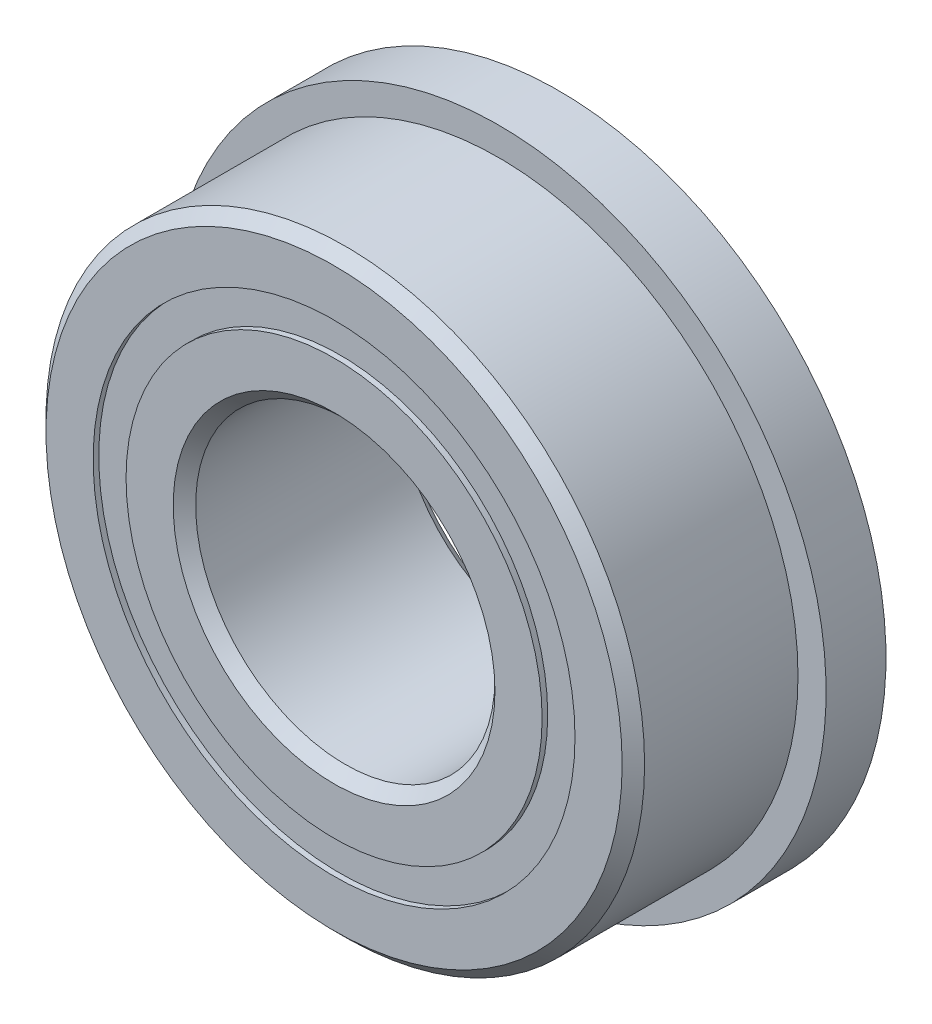
ISO-10303-21;
HEADER;
FILE_DESCRIPTION(('STEP AP214'),'2;1');
FILE_NAME('part.step','',(''),(''),'','','');
FILE_SCHEMA(('AUTOMOTIVE_DESIGN { 1 0 10303 214 1 1 1 1 }'));
ENDSEC;
DATA;
#1=APPLICATION_CONTEXT('core data for automotive mechanical design processes');
#2=APPLICATION_PROTOCOL_DEFINITION('international standard','automotive_design',2000,#1);
#3=PRODUCT_CONTEXT('',#1,'mechanical');
#4=PRODUCT('Part','Part','',(#3));
#5=PRODUCT_RELATED_PRODUCT_CATEGORY('part','',(#4));
#6=PRODUCT_DEFINITION_FORMATION('','',#4);
#7=PRODUCT_DEFINITION_CONTEXT('part definition',#1,'design');
#8=PRODUCT_DEFINITION('design','',#6,#7);
#9=PRODUCT_DEFINITION_SHAPE('','',#8);
#10=(LENGTH_UNIT() NAMED_UNIT(*) SI_UNIT(.MILLI.,.METRE.));
#11=(NAMED_UNIT(*) PLANE_ANGLE_UNIT() SI_UNIT($,.RADIAN.));
#12=(NAMED_UNIT(*) SI_UNIT($,.STERADIAN.) SOLID_ANGLE_UNIT());
#13=UNCERTAINTY_MEASURE_WITH_UNIT(LENGTH_MEASURE(1.E-05),#10,'distance_accuracy_value','');
#14=(GEOMETRIC_REPRESENTATION_CONTEXT(3) GLOBAL_UNCERTAINTY_ASSIGNED_CONTEXT((#13)) GLOBAL_UNIT_ASSIGNED_CONTEXT((#10,
#11,#12)) REPRESENTATION_CONTEXT('',''));
#15=CARTESIAN_POINT('',(0.,0.,0.));
#16=DIRECTION('',(0.,0.,1.));
#17=DIRECTION('',(1.,0.,0.));
#18=AXIS2_PLACEMENT_3D('',#15,#16,#17);
#19=CARTESIAN_POINT('',(0.,5.1114010989011,-2.2621875));
#20=DIRECTION('',(0.,0.,1.));
#21=DIRECTION('',(1.,0.,0.));
#22=AXIS2_PLACEMENT_3D('',#19,#20,#21);
#23=PLANE('',#22);
#24=CARTESIAN_POINT('',(0.,0.,-2.2621875));
#25=DIRECTION('',(0.,0.,1.));
#26=DIRECTION('',(1.,0.,0.));
#27=AXIS2_PLACEMENT_3D('',#24,#25,#26);
#28=CIRCLE('',#27,5.1114010989011);
#29=CARTESIAN_POINT('',(5.1114010989011,0.,-2.2621875));
#30=VERTEX_POINT('',#29);
#31=EDGE_CURVE('E59',#30,#30,#28,.T.);
#32=ORIENTED_EDGE('',*,*,#31,.F.);
#33=EDGE_LOOP('',(#32));
#34=FACE_BOUND('',#33,.T.);
#35=CARTESIAN_POINT('',(0.,0.,-2.2621875));
#36=DIRECTION('',(0.,0.,1.));
#37=DIRECTION('',(1.,0.,0.));
#38=AXIS2_PLACEMENT_3D('',#35,#36,#37);
#39=CIRCLE('',#38,4.4135989010989);
#40=CARTESIAN_POINT('',(4.4135989010989,0.,-2.2621875));
#41=VERTEX_POINT('',#40);
#42=EDGE_CURVE('E11',#41,#41,#39,.T.);
#43=ORIENTED_EDGE('',*,*,#42,.T.);
#44=EDGE_LOOP('',(#43));
#45=FACE_BOUND('',#44,.T.);
#46=ADVANCED_FACE('F45',(#34,#45),#23,.F.);
#47=CARTESIAN_POINT('',(0.,0.,2.38125));
#48=DIRECTION('',(0.,0.,1.));
#49=DIRECTION('',(1.,0.,0.));
#50=AXIS2_PLACEMENT_3D('',#47,#48,#49);
#51=CYLINDRICAL_SURFACE('',#50,4.4135989010989);
#52=ORIENTED_EDGE('',*,*,#42,.F.);
#53=EDGE_LOOP('',(#52));
#54=FACE_BOUND('',#53,.T.);
#55=CARTESIAN_POINT('',(0.,0.,-1.11436144103197));
#56=DIRECTION('',(0.,0.,1.));
#57=DIRECTION('',(1.,0.,0.));
#58=AXIS2_PLACEMENT_3D('',#55,#56,#57);
#59=CIRCLE('',#58,4.4135989010989);
#60=CARTESIAN_POINT('',(4.4135989010989,0.,-1.11436144103197));
#61=VERTEX_POINT('',#60);
#62=EDGE_CURVE('E51',#61,#61,#59,.T.);
#63=ORIENTED_EDGE('',*,*,#62,.T.);
#64=EDGE_LOOP('',(#63));
#65=FACE_BOUND('',#64,.T.);
#66=ADVANCED_FACE('F68',(#54,#65),#51,.F.);
#67=CARTESIAN_POINT('',(0.,5.1114010989011,-1.11436144103197));
#68=DIRECTION('',(0.,0.,-1.));
#69=DIRECTION('',(-1.,0.,0.));
#70=AXIS2_PLACEMENT_3D('',#67,#68,#69);
#71=PLANE('',#70);
#72=ORIENTED_EDGE('',*,*,#62,.F.);
#73=EDGE_LOOP('',(#72));
#74=FACE_BOUND('',#73,.T.);
#75=CARTESIAN_POINT('',(0.,0.,-1.11436144103197));
#76=DIRECTION('',(0.,0.,1.));
#77=DIRECTION('',(1.,0.,0.));
#78=AXIS2_PLACEMENT_3D('',#75,#76,#77);
#79=CIRCLE('',#78,5.1114010989011);
#80=CARTESIAN_POINT('',(5.1114010989011,0.,-1.11436144103197));
#81=VERTEX_POINT('',#80);
#82=EDGE_CURVE('E55',#81,#81,#79,.T.);
#83=ORIENTED_EDGE('',*,*,#82,.T.);
#84=EDGE_LOOP('',(#83));
#85=FACE_BOUND('',#84,.T.);
#86=ADVANCED_FACE('F72',(#74,#85),#71,.F.);
#87=CARTESIAN_POINT('',(0.,0.,2.38125));
#88=DIRECTION('',(0.,0.,1.));
#89=DIRECTION('',(1.,0.,0.));
#90=AXIS2_PLACEMENT_3D('',#87,#88,#89);
#91=CYLINDRICAL_SURFACE('',#90,5.1114010989011);
#92=ORIENTED_EDGE('',*,*,#82,.F.);
#93=EDGE_LOOP('',(#92));
#94=FACE_BOUND('',#93,.T.);
#95=ORIENTED_EDGE('',*,*,#31,.T.);
#96=EDGE_LOOP('',(#95));
#97=FACE_BOUND('',#96,.T.);
#98=ADVANCED_FACE('F65',(#94,#97),#91,.T.);
#99=CLOSED_SHELL('',(#46,#66,#86,#98));
#100=MANIFOLD_SOLID_BREP('B2',#99);
#101=CARTESIAN_POINT('',(0.,5.1114010989011,2.2621875));
#102=DIRECTION('',(0.,0.,-1.));
#103=DIRECTION('',(-1.,0.,0.));
#104=AXIS2_PLACEMENT_3D('',#101,#102,#103);
#105=PLANE('',#104);
#106=CARTESIAN_POINT('',(0.,0.,2.2621875));
#107=DIRECTION('',(0.,0.,1.));
#108=DIRECTION('',(1.,0.,0.));
#109=AXIS2_PLACEMENT_3D('',#106,#107,#108);
#110=CIRCLE('',#109,4.4135989010989);
#111=CARTESIAN_POINT('',(4.4135989010989,0.,2.2621875));
#112=VERTEX_POINT('',#111);
#113=EDGE_CURVE('E44',#112,#112,#110,.T.);
#114=ORIENTED_EDGE('',*,*,#113,.F.);
#115=EDGE_LOOP('',(#114));
#116=FACE_BOUND('',#115,.T.);
#117=CARTESIAN_POINT('',(0.,0.,2.2621875));
#118=DIRECTION('',(0.,0.,1.));
#119=DIRECTION('',(1.,0.,0.));
#120=AXIS2_PLACEMENT_3D('',#117,#118,#119);
#121=CIRCLE('',#120,5.1114010989011);
#122=CARTESIAN_POINT('',(5.1114010989011,0.,2.2621875));
#123=VERTEX_POINT('',#122);
#124=EDGE_CURVE('E126',#123,#123,#121,.T.);
#125=ORIENTED_EDGE('',*,*,#124,.T.);
#126=EDGE_LOOP('',(#125));
#127=FACE_BOUND('',#126,.T.);
#128=ADVANCED_FACE('F112',(#116,#127),#105,.F.);
#129=CARTESIAN_POINT('',(0.,0.,2.38125));
#130=DIRECTION('',(0.,0.,1.));
#131=DIRECTION('',(1.,0.,0.));
#132=AXIS2_PLACEMENT_3D('',#129,#130,#131);
#133=CYLINDRICAL_SURFACE('',#132,4.4135989010989);
#134=CARTESIAN_POINT('',(0.,0.,1.11436144103197));
#135=DIRECTION('',(0.,0.,1.));
#136=DIRECTION('',(1.,0.,0.));
#137=AXIS2_PLACEMENT_3D('',#134,#135,#136);
#138=CIRCLE('',#137,4.4135989010989);
#139=CARTESIAN_POINT('',(4.4135989010989,0.,1.11436144103197));
#140=VERTEX_POINT('',#139);
#141=EDGE_CURVE('E118',#140,#140,#138,.T.);
#142=ORIENTED_EDGE('',*,*,#141,.F.);
#143=EDGE_LOOP('',(#142));
#144=FACE_BOUND('',#143,.T.);
#145=ORIENTED_EDGE('',*,*,#113,.T.);
#146=EDGE_LOOP('',(#145));
#147=FACE_BOUND('',#146,.T.);
#148=ADVANCED_FACE('F141',(#144,#147),#133,.F.);
#149=CARTESIAN_POINT('',(0.,5.1114010989011,1.11436144103197));
#150=DIRECTION('',(0.,0.,1.));
#151=DIRECTION('',(1.,0.,0.));
#152=AXIS2_PLACEMENT_3D('',#149,#150,#151);
#153=PLANE('',#152);
#154=CARTESIAN_POINT('',(0.,0.,1.11436144103197));
#155=DIRECTION('',(0.,0.,1.));
#156=DIRECTION('',(1.,0.,0.));
#157=AXIS2_PLACEMENT_3D('',#154,#155,#156);
#158=CIRCLE('',#157,5.1114010989011);
#159=CARTESIAN_POINT('',(5.1114010989011,0.,1.11436144103197));
#160=VERTEX_POINT('',#159);
#161=EDGE_CURVE('E122',#160,#160,#158,.T.);
#162=ORIENTED_EDGE('',*,*,#161,.F.);
#163=EDGE_LOOP('',(#162));
#164=FACE_BOUND('',#163,.T.);
#165=ORIENTED_EDGE('',*,*,#141,.T.);
#166=EDGE_LOOP('',(#165));
#167=FACE_BOUND('',#166,.T.);
#168=ADVANCED_FACE('F136',(#164,#167),#153,.F.);
#169=CARTESIAN_POINT('',(0.,0.,2.38125));
#170=DIRECTION('',(0.,0.,1.));
#171=DIRECTION('',(1.,0.,0.));
#172=AXIS2_PLACEMENT_3D('',#169,#170,#171);
#173=CYLINDRICAL_SURFACE('',#172,5.1114010989011);
#174=ORIENTED_EDGE('',*,*,#124,.F.);
#175=EDGE_LOOP('',(#174));
#176=FACE_BOUND('',#175,.T.);
#177=ORIENTED_EDGE('',*,*,#161,.T.);
#178=EDGE_LOOP('',(#177));
#179=FACE_BOUND('',#178,.T.);
#180=ADVANCED_FACE('F133',(#176,#179),#173,.T.);
#181=CLOSED_SHELL('',(#128,#148,#168,#180));
#182=MANIFOLD_SOLID_BREP('B6',#181);
#183=CARTESIAN_POINT('',(-2.38124999999995,4.12444598552342,0.));
#184=DIRECTION('',(0.,0.,1.));
#185=DIRECTION('',(-0.499999999999989,0.866025403784445,0.));
#186=AXIS2_PLACEMENT_3D('',#183,#184,#185);
#187=SPHERICAL_SURFACE('',#186,1.11436144103197);
#188=CARTESIAN_POINT('',(-2.38124999999995,4.12444598552342,1.11436144103197));
#189=VERTEX_POINT('',#188);
#190=VERTEX_LOOP('',#189);
#191=FACE_BOUND('',#190,.T.);
#192=ADVANCED_FACE('F179',(#191),#187,.T.);
#193=CLOSED_SHELL('',(#192));
#194=MANIFOLD_SOLID_BREP('B39',#193);
#195=CARTESIAN_POINT('',(-4.12444598552336,2.38125000000005,0.));
#196=DIRECTION('',(0.,0.,1.));
#197=DIRECTION('',(-0.866025403784433,0.50000000000001,0.));
#198=AXIS2_PLACEMENT_3D('',#195,#196,#197);
#199=SPHERICAL_SURFACE('',#198,1.11436144103197);
#200=CARTESIAN_POINT('',(-4.12444598552336,2.38125000000005,1.11436144103197));
#201=VERTEX_POINT('',#200);
#202=VERTEX_LOOP('',#201);
#203=FACE_BOUND('',#202,.T.);
#204=ADVANCED_FACE('F199',(#203),#199,.T.);
#205=CLOSED_SHELL('',(#204));
#206=MANIFOLD_SOLID_BREP('B108',#205);
#207=CARTESIAN_POINT('',(-4.7625,0.,0.));
#208=DIRECTION('',(0.,0.,1.));
#209=DIRECTION('',(-1.,0.,0.));
#210=AXIS2_PLACEMENT_3D('',#207,#208,#209);
#211=SPHERICAL_SURFACE('',#210,1.11436144103197);
#212=CARTESIAN_POINT('',(-4.7625,0.,1.11436144103197));
#213=VERTEX_POINT('',#212);
#214=VERTEX_LOOP('',#213);
#215=FACE_BOUND('',#214,.T.);
#216=ADVANCED_FACE('F219',(#215),#211,.T.);
#217=CLOSED_SHELL('',(#216));
#218=MANIFOLD_SOLID_BREP('B175',#217);
#219=CARTESIAN_POINT('',(-4.12444598552341,-2.38124999999996,0.));
#220=DIRECTION('',(0.,0.,1.));
#221=DIRECTION('',(-0.866025403784443,-0.499999999999992,0.));
#222=AXIS2_PLACEMENT_3D('',#219,#220,#221);
#223=SPHERICAL_SURFACE('',#222,1.11436144103197);
#224=CARTESIAN_POINT('',(-4.12444598552341,-2.38124999999996,1.11436144103197));
#225=VERTEX_POINT('',#224);
#226=VERTEX_LOOP('',#225);
#227=FACE_BOUND('',#226,.T.);
#228=ADVANCED_FACE('F239',(#227),#223,.T.);
#229=CLOSED_SHELL('',(#228));
#230=MANIFOLD_SOLID_BREP('B195',#229);
#231=CARTESIAN_POINT('',(-2.38125000000003,-4.12444598552337,0.));
#232=DIRECTION('',(0.,0.,1.));
#233=DIRECTION('',(-0.500000000000007,-0.866025403784435,0.));
#234=AXIS2_PLACEMENT_3D('',#231,#232,#233);
#235=SPHERICAL_SURFACE('',#234,1.11436144103197);
#236=CARTESIAN_POINT('',(-2.38125000000003,-4.12444598552337,1.11436144103197));
#237=VERTEX_POINT('',#236);
#238=VERTEX_LOOP('',#237);
#239=FACE_BOUND('',#238,.T.);
#240=ADVANCED_FACE('F259',(#239),#235,.T.);
#241=CLOSED_SHELL('',(#240));
#242=MANIFOLD_SOLID_BREP('B215',#241);
#243=CARTESIAN_POINT('',(0.,-4.7625,0.));
#244=DIRECTION('',(0.,0.,1.));
#245=DIRECTION('',(0.,-1.,0.));
#246=AXIS2_PLACEMENT_3D('',#243,#244,#245);
#247=SPHERICAL_SURFACE('',#246,1.11436144103197);
#248=CARTESIAN_POINT('',(0.,-4.7625,1.11436144103197));
#249=VERTEX_POINT('',#248);
#250=VERTEX_LOOP('',#249);
#251=FACE_BOUND('',#250,.T.);
#252=ADVANCED_FACE('F279',(#251),#247,.T.);
#253=CLOSED_SHELL('',(#252));
#254=MANIFOLD_SOLID_BREP('B235',#253);
#255=CARTESIAN_POINT('',(2.38124999999998,-4.1244459855234,0.));
#256=DIRECTION('',(0.,0.,1.));
#257=DIRECTION('',(0.499999999999995,-0.866025403784442,0.));
#258=AXIS2_PLACEMENT_3D('',#255,#256,#257);
#259=SPHERICAL_SURFACE('',#258,1.11436144103197);
#260=CARTESIAN_POINT('',(2.38124999999998,-4.1244459855234,1.11436144103197));
#261=VERTEX_POINT('',#260);
#262=VERTEX_LOOP('',#261);
#263=FACE_BOUND('',#262,.T.);
#264=ADVANCED_FACE('F299',(#263),#259,.T.);
#265=CLOSED_SHELL('',(#264));
#266=MANIFOLD_SOLID_BREP('B255',#265);
#267=CARTESIAN_POINT('',(4.12444598552338,-2.38125000000002,0.));
#268=DIRECTION('',(0.,0.,1.));
#269=DIRECTION('',(0.866025403784436,-0.500000000000004,0.));
#270=AXIS2_PLACEMENT_3D('',#267,#268,#269);
#271=SPHERICAL_SURFACE('',#270,1.11436144103197);
#272=CARTESIAN_POINT('',(4.12444598552338,-2.38125000000002,1.11436144103197));
#273=VERTEX_POINT('',#272);
#274=VERTEX_LOOP('',#273);
#275=FACE_BOUND('',#274,.T.);
#276=ADVANCED_FACE('F319',(#275),#271,.T.);
#277=CLOSED_SHELL('',(#276));
#278=MANIFOLD_SOLID_BREP('B275',#277);
#279=CARTESIAN_POINT('',(4.7625,0.,0.));
#280=DIRECTION('',(0.,0.,1.));
#281=DIRECTION('',(1.,0.,0.));
#282=AXIS2_PLACEMENT_3D('',#279,#280,#281);
#283=SPHERICAL_SURFACE('',#282,1.11436144103197);
#284=CARTESIAN_POINT('',(4.7625,0.,1.11436144103197));
#285=VERTEX_POINT('',#284);
#286=VERTEX_LOOP('',#285);
#287=FACE_BOUND('',#286,.T.);
#288=ADVANCED_FACE('F339',(#287),#283,.T.);
#289=CLOSED_SHELL('',(#288));
#290=MANIFOLD_SOLID_BREP('B295',#289);
#291=CARTESIAN_POINT('',(4.12444598552339,2.38124999999999,0.));
#292=DIRECTION('',(0.,0.,1.));
#293=DIRECTION('',(0.86602540378444,0.499999999999998,0.));
#294=AXIS2_PLACEMENT_3D('',#291,#292,#293);
#295=SPHERICAL_SURFACE('',#294,1.11436144103197);
#296=CARTESIAN_POINT('',(4.12444598552339,2.38124999999999,1.11436144103197));
#297=VERTEX_POINT('',#296);
#298=VERTEX_LOOP('',#297);
#299=FACE_BOUND('',#298,.T.);
#300=ADVANCED_FACE('F359',(#299),#295,.T.);
#301=CLOSED_SHELL('',(#300));
#302=MANIFOLD_SOLID_BREP('B315',#301);
#303=CARTESIAN_POINT('',(2.38125,4.12444598552339,0.));
#304=DIRECTION('',(0.,0.,1.));
#305=DIRECTION('',(0.500000000000001,0.866025403784438,0.));
#306=AXIS2_PLACEMENT_3D('',#303,#304,#305);
#307=SPHERICAL_SURFACE('',#306,1.11436144103197);
#308=CARTESIAN_POINT('',(2.38125,4.12444598552339,1.11436144103197));
#309=VERTEX_POINT('',#308);
#310=VERTEX_LOOP('',#309);
#311=FACE_BOUND('',#310,.T.);
#312=ADVANCED_FACE('F379',(#311),#307,.T.);
#313=CLOSED_SHELL('',(#312));
#314=MANIFOLD_SOLID_BREP('B335',#313);
#315=CARTESIAN_POINT('',(0.,4.7625,0.));
#316=DIRECTION('',(0.,0.,1.));
#317=DIRECTION('',(0.,1.,0.));
#318=AXIS2_PLACEMENT_3D('',#315,#316,#317);
#319=SPHERICAL_SURFACE('',#318,1.11436144103197);
#320=CARTESIAN_POINT('',(0.,4.7625,1.11436144103197));
#321=VERTEX_POINT('',#320);
#322=VERTEX_LOOP('',#321);
#323=FACE_BOUND('',#322,.T.);
#324=ADVANCED_FACE('F401',(#323),#319,.T.);
#325=CLOSED_SHELL('',(#324));
#326=MANIFOLD_SOLID_BREP('B355',#325);
#327=CARTESIAN_POINT('',(0.,4.4135989010989,2.38125));
#328=DIRECTION('',(0.,0.,-1.));
#329=DIRECTION('',(-1.,0.,0.));
#330=AXIS2_PLACEMENT_3D('',#327,#328,#329);
#331=PLANE('',#330);
#332=CARTESIAN_POINT('',(0.,0.,2.38125));
#333=DIRECTION('',(0.,0.,1.));
#334=DIRECTION('',(1.,0.,0.));
#335=AXIS2_PLACEMENT_3D('',#332,#333,#334);
#336=CIRCLE('',#335,3.413125);
#337=CARTESIAN_POINT('',(3.413125,0.,2.38125));
#338=VERTEX_POINT('',#337);
#339=EDGE_CURVE('E448',#338,#338,#336,.T.);
#340=ORIENTED_EDGE('',*,*,#339,.F.);
#341=EDGE_LOOP('',(#340));
#342=FACE_BOUND('',#341,.T.);
#343=CARTESIAN_POINT('',(0.,0.,2.38125));
#344=DIRECTION('',(0.,0.,1.));
#345=DIRECTION('',(1.,0.,0.));
#346=AXIS2_PLACEMENT_3D('',#343,#344,#345);
#347=CIRCLE('',#346,4.4135989010989);
#348=CARTESIAN_POINT('',(4.4135989010989,0.,2.38125));
#349=VERTEX_POINT('',#348);
#350=EDGE_CURVE('E400',#349,#349,#347,.T.);
#351=ORIENTED_EDGE('',*,*,#350,.T.);
#352=EDGE_LOOP('',(#351));
#353=FACE_BOUND('',#352,.T.);
#354=ADVANCED_FACE('F420',(#342,#353),#331,.F.);
#355=CARTESIAN_POINT('',(0.,0.,2.38125));
#356=DIRECTION('',(0.,0.,1.));
#357=DIRECTION('',(1.,0.,0.));
#358=AXIS2_PLACEMENT_3D('',#355,#356,#357);
#359=CYLINDRICAL_SURFACE('',#358,4.4135989010989);
#360=ORIENTED_EDGE('',*,*,#350,.F.);
#361=EDGE_LOOP('',(#360));
#362=FACE_BOUND('',#361,.T.);
#363=CARTESIAN_POINT('',(0.,0.,1.05833333333333));
#364=DIRECTION('',(0.,0.,1.));
#365=DIRECTION('',(1.,0.,0.));
#366=AXIS2_PLACEMENT_3D('',#363,#364,#365);
#367=CIRCLE('',#366,4.4135989010989);
#368=CARTESIAN_POINT('',(4.4135989010989,0.,1.05833333333333));
#369=VERTEX_POINT('',#368);
#370=EDGE_CURVE('E426',#369,#369,#367,.T.);
#371=ORIENTED_EDGE('',*,*,#370,.T.);
#372=EDGE_LOOP('',(#371));
#373=FACE_BOUND('',#372,.T.);
#374=ADVANCED_FACE('F455',(#362,#373),#359,.T.);
#375=CARTESIAN_POINT('',(0.,0.,0.));
#376=DIRECTION('',(0.,0.,1.));
#377=DIRECTION('',(1.,0.,0.));
#378=AXIS2_PLACEMENT_3D('',#375,#376,#377);
#379=TOROIDAL_SURFACE('',#378,4.76249999999999,1.11436144103196);
#380=ORIENTED_EDGE('',*,*,#370,.F.);
#381=EDGE_LOOP('',(#380));
#382=FACE_BOUND('',#381,.T.);
#383=CARTESIAN_POINT('',(0.,0.,-1.05833333333333));
#384=DIRECTION('',(0.,0.,1.));
#385=DIRECTION('',(1.,0.,0.));
#386=AXIS2_PLACEMENT_3D('',#383,#384,#385);
#387=CIRCLE('',#386,4.4135989010989);
#388=CARTESIAN_POINT('',(4.4135989010989,0.,-1.05833333333333));
#389=VERTEX_POINT('',#388);
#390=EDGE_CURVE('E430',#389,#389,#387,.T.);
#391=ORIENTED_EDGE('',*,*,#390,.T.);
#392=EDGE_LOOP('',(#391));
#393=FACE_BOUND('',#392,.T.);
#394=ADVANCED_FACE('F459',(#382,#393),#379,.F.);
#395=CARTESIAN_POINT('',(0.,0.,2.38125));
#396=DIRECTION('',(0.,0.,1.));
#397=DIRECTION('',(1.,0.,0.));
#398=AXIS2_PLACEMENT_3D('',#395,#396,#397);
#399=CYLINDRICAL_SURFACE('',#398,4.4135989010989);
#400=ORIENTED_EDGE('',*,*,#390,.F.);
#401=EDGE_LOOP('',(#400));
#402=FACE_BOUND('',#401,.T.);
#403=CARTESIAN_POINT('',(0.,0.,-2.38125));
#404=DIRECTION('',(0.,0.,1.));
#405=DIRECTION('',(1.,0.,0.));
#406=AXIS2_PLACEMENT_3D('',#403,#404,#405);
#407=CIRCLE('',#406,4.4135989010989);
#408=CARTESIAN_POINT('',(4.4135989010989,0.,-2.38125));
#409=VERTEX_POINT('',#408);
#410=EDGE_CURVE('E434',#409,#409,#407,.T.);
#411=ORIENTED_EDGE('',*,*,#410,.T.);
#412=EDGE_LOOP('',(#411));
#413=FACE_BOUND('',#412,.T.);
#414=ADVANCED_FACE('F464',(#402,#413),#399,.T.);
#415=CARTESIAN_POINT('',(0.,3.413125,-2.38125));
#416=DIRECTION('',(0.,0.,1.));
#417=DIRECTION('',(1.,0.,0.));
#418=AXIS2_PLACEMENT_3D('',#415,#416,#417);
#419=PLANE('',#418);
#420=ORIENTED_EDGE('',*,*,#410,.F.);
#421=EDGE_LOOP('',(#420));
#422=FACE_BOUND('',#421,.T.);
#423=CARTESIAN_POINT('',(0.,0.,-2.38125));
#424=DIRECTION('',(0.,0.,1.));
#425=DIRECTION('',(1.,0.,0.));
#426=AXIS2_PLACEMENT_3D('',#423,#424,#425);
#427=CIRCLE('',#426,3.413125);
#428=CARTESIAN_POINT('',(3.413125,0.,-2.38125));
#429=VERTEX_POINT('',#428);
#430=EDGE_CURVE('E439',#429,#429,#427,.T.);
#431=ORIENTED_EDGE('',*,*,#430,.T.);
#432=EDGE_LOOP('',(#431));
#433=FACE_BOUND('',#432,.T.);
#434=ADVANCED_FACE('F470',(#422,#433),#419,.F.);
#435=CARTESIAN_POINT('',(0.,0.,-2.143125));
#436=DIRECTION('',(0.,0.,-1.));
#437=DIRECTION('',(-1.,0.,0.));
#438=AXIS2_PLACEMENT_3D('',#435,#436,#437);
#439=CONICAL_SURFACE('',#438,3.175,0.785398163397447);
#440=ORIENTED_EDGE('',*,*,#430,.F.);
#441=EDGE_LOOP('',(#440));
#442=FACE_BOUND('',#441,.T.);
#443=CARTESIAN_POINT('',(0.,0.,-2.143125));
#444=DIRECTION('',(0.,0.,1.));
#445=DIRECTION('',(1.,0.,0.));
#446=AXIS2_PLACEMENT_3D('',#443,#444,#445);
#447=CIRCLE('',#446,3.175);
#448=CARTESIAN_POINT('',(3.175,0.,-2.143125));
#449=VERTEX_POINT('',#448);
#450=EDGE_CURVE('E442',#449,#449,#447,.T.);
#451=ORIENTED_EDGE('',*,*,#450,.T.);
#452=EDGE_LOOP('',(#451));
#453=FACE_BOUND('',#452,.T.);
#454=ADVANCED_FACE('F474',(#442,#453),#439,.F.);
#455=CARTESIAN_POINT('',(0.,0.,2.38125));
#456=DIRECTION('',(0.,0.,1.));
#457=DIRECTION('',(1.,0.,0.));
#458=AXIS2_PLACEMENT_3D('',#455,#456,#457);
#459=CYLINDRICAL_SURFACE('',#458,3.175);
#460=ORIENTED_EDGE('',*,*,#450,.F.);
#461=EDGE_LOOP('',(#460));
#462=FACE_BOUND('',#461,.T.);
#463=CARTESIAN_POINT('',(0.,0.,2.143125));
#464=DIRECTION('',(0.,0.,1.));
#465=DIRECTION('',(1.,0.,0.));
#466=AXIS2_PLACEMENT_3D('',#463,#464,#465);
#467=CIRCLE('',#466,3.175);
#468=CARTESIAN_POINT('',(3.175,0.,2.143125));
#469=VERTEX_POINT('',#468);
#470=EDGE_CURVE('E445',#469,#469,#467,.T.);
#471=ORIENTED_EDGE('',*,*,#470,.T.);
#472=EDGE_LOOP('',(#471));
#473=FACE_BOUND('',#472,.T.);
#474=ADVANCED_FACE('F478',(#462,#473),#459,.F.);
#475=CARTESIAN_POINT('',(0.,0.,2.38125));
#476=DIRECTION('',(0.,0.,1.));
#477=DIRECTION('',(1.,0.,0.));
#478=AXIS2_PLACEMENT_3D('',#475,#476,#477);
#479=CONICAL_SURFACE('',#478,3.413125,0.785398163397448);
#480=ORIENTED_EDGE('',*,*,#470,.F.);
#481=EDGE_LOOP('',(#480));
#482=FACE_BOUND('',#481,.T.);
#483=ORIENTED_EDGE('',*,*,#339,.T.);
#484=EDGE_LOOP('',(#483));
#485=FACE_BOUND('',#484,.T.);
#486=ADVANCED_FACE('F452',(#482,#485),#479,.F.);
#487=CLOSED_SHELL('',(#354,#374,#394,#414,#434,#454,#474,#486));
#488=MANIFOLD_SOLID_BREP('B375',#487);
#489=CARTESIAN_POINT('',(0.,0.,2.143125));
#490=DIRECTION('',(0.,0.,-1.));
#491=DIRECTION('',(-1.,0.,0.));
#492=AXIS2_PLACEMENT_3D('',#489,#490,#491);
#493=CONICAL_SURFACE('',#492,6.35,0.785398163397449);
#494=CARTESIAN_POINT('',(0.,0.,2.38125));
#495=DIRECTION('',(0.,0.,1.));
#496=DIRECTION('',(1.,0.,0.));
#497=AXIS2_PLACEMENT_3D('',#494,#495,#496);
#498=CIRCLE('',#497,6.111875);
#499=CARTESIAN_POINT('',(6.111875,0.,2.38125));
#500=VERTEX_POINT('',#499);
#501=EDGE_CURVE('E563',#500,#500,#498,.T.);
#502=ORIENTED_EDGE('',*,*,#501,.F.);
#503=EDGE_LOOP('',(#502));
#504=FACE_BOUND('',#503,.T.);
#505=CARTESIAN_POINT('',(0.,0.,2.143125));
#506=DIRECTION('',(0.,0.,1.));
#507=DIRECTION('',(1.,0.,0.));
#508=AXIS2_PLACEMENT_3D('',#505,#506,#507);
#509=CIRCLE('',#508,6.35);
#510=CARTESIAN_POINT('',(6.35,0.,2.143125));
#511=VERTEX_POINT('',#510);
#512=EDGE_CURVE('E419',#511,#511,#509,.T.);
#513=ORIENTED_EDGE('',*,*,#512,.T.);
#514=EDGE_LOOP('',(#513));
#515=FACE_BOUND('',#514,.T.);
#516=ADVANCED_FACE('F541',(#504,#515),#493,.T.);
#517=CARTESIAN_POINT('',(0.,0.,2.38125));
#518=DIRECTION('',(0.,0.,1.));
#519=DIRECTION('',(1.,0.,0.));
#520=AXIS2_PLACEMENT_3D('',#517,#518,#519);
#521=CYLINDRICAL_SURFACE('',#520,6.35);
#522=CARTESIAN_POINT('',(0.,0.,-1.11125));
#523=DIRECTION('',(0.,0.,1.));
#524=DIRECTION('',(1.,0.,0.));
#525=AXIS2_PLACEMENT_3D('',#522,#523,#524);
#526=CIRCLE('',#525,6.35);
#527=CARTESIAN_POINT('',(6.35,0.,-1.11125));
#528=VERTEX_POINT('',#527);
#529=EDGE_CURVE('E566',#528,#528,#526,.T.);
#530=ORIENTED_EDGE('',*,*,#529,.T.);
#531=EDGE_LOOP('',(#530));
#532=FACE_BOUND('',#531,.T.);
#533=ORIENTED_EDGE('',*,*,#512,.F.);
#534=EDGE_LOOP('',(#533));
#535=FACE_BOUND('',#534,.T.);
#536=ADVANCED_FACE('F586',(#532,#535),#521,.T.);
#537=CARTESIAN_POINT('',(0.,6.111875,-2.38125));
#538=DIRECTION('',(0.,0.,1.));
#539=DIRECTION('',(1.,0.,0.));
#540=AXIS2_PLACEMENT_3D('',#537,#538,#539);
#541=PLANE('',#540);
#542=CARTESIAN_POINT('',(0.,0.,-2.38125));
#543=DIRECTION('',(0.,0.,1.));
#544=DIRECTION('',(1.,0.,0.));
#545=AXIS2_PLACEMENT_3D('',#542,#543,#544);
#546=CIRCLE('',#545,5.1114010989011);
#547=CARTESIAN_POINT('',(5.1114010989011,0.,-2.38125));
#548=VERTEX_POINT('',#547);
#549=EDGE_CURVE('E547',#548,#548,#546,.T.);
#550=ORIENTED_EDGE('',*,*,#549,.T.);
#551=EDGE_LOOP('',(#550));
#552=FACE_BOUND('',#551,.T.);
#553=CARTESIAN_POINT('',(0.,0.,-2.38125));
#554=DIRECTION('',(0.,0.,-1.));
#555=DIRECTION('',(-1.,0.,0.));
#556=AXIS2_PLACEMENT_3D('',#553,#554,#555);
#557=CIRCLE('',#556,6.9469);
#558=CARTESIAN_POINT('',(-6.9469,0.,-2.38125));
#559=VERTEX_POINT('',#558);
#560=EDGE_CURVE('E569',#559,#559,#557,.T.);
#561=ORIENTED_EDGE('',*,*,#560,.T.);
#562=EDGE_LOOP('',(#561));
#563=FACE_BOUND('',#562,.T.);
#564=ADVANCED_FACE('F589',(#552,#563),#541,.F.);
#565=CARTESIAN_POINT('',(0.,0.,2.38125));
#566=DIRECTION('',(0.,0.,1.));
#567=DIRECTION('',(1.,0.,0.));
#568=AXIS2_PLACEMENT_3D('',#565,#566,#567);
#569=CYLINDRICAL_SURFACE('',#568,5.1114010989011);
#570=CARTESIAN_POINT('',(0.,0.,-1.05833333333333));
#571=DIRECTION('',(0.,0.,1.));
#572=DIRECTION('',(1.,0.,0.));
#573=AXIS2_PLACEMENT_3D('',#570,#571,#572);
#574=CIRCLE('',#573,5.1114010989011);
#575=CARTESIAN_POINT('',(5.1114010989011,0.,-1.05833333333333));
#576=VERTEX_POINT('',#575);
#577=EDGE_CURVE('E551',#576,#576,#574,.T.);
#578=ORIENTED_EDGE('',*,*,#577,.T.);
#579=EDGE_LOOP('',(#578));
#580=FACE_BOUND('',#579,.T.);
#581=ORIENTED_EDGE('',*,*,#549,.F.);
#582=EDGE_LOOP('',(#581));
#583=FACE_BOUND('',#582,.T.);
#584=ADVANCED_FACE('F594',(#580,#583),#569,.F.);
#585=CARTESIAN_POINT('',(0.,0.,0.));
#586=DIRECTION('',(0.,0.,1.));
#587=DIRECTION('',(1.,0.,0.));
#588=AXIS2_PLACEMENT_3D('',#585,#586,#587);
#589=TOROIDAL_SURFACE('',#588,4.7625,1.11436144103197);
#590=ORIENTED_EDGE('',*,*,#577,.F.);
#591=EDGE_LOOP('',(#590));
#592=FACE_BOUND('',#591,.T.);
#593=CARTESIAN_POINT('',(0.,0.,1.05833333333333));
#594=DIRECTION('',(0.,0.,1.));
#595=DIRECTION('',(1.,0.,0.));
#596=AXIS2_PLACEMENT_3D('',#593,#594,#595);
#597=CIRCLE('',#596,5.1114010989011);
#598=CARTESIAN_POINT('',(5.1114010989011,0.,1.05833333333333));
#599=VERTEX_POINT('',#598);
#600=EDGE_CURVE('E555',#599,#599,#597,.T.);
#601=ORIENTED_EDGE('',*,*,#600,.T.);
#602=EDGE_LOOP('',(#601));
#603=FACE_BOUND('',#602,.T.);
#604=ADVANCED_FACE('F600',(#592,#603),#589,.F.);
#605=CARTESIAN_POINT('',(0.,0.,2.38125));
#606=DIRECTION('',(0.,0.,1.));
#607=DIRECTION('',(1.,0.,0.));
#608=AXIS2_PLACEMENT_3D('',#605,#606,#607);
#609=CYLINDRICAL_SURFACE('',#608,5.1114010989011);
#610=ORIENTED_EDGE('',*,*,#600,.F.);
#611=EDGE_LOOP('',(#610));
#612=FACE_BOUND('',#611,.T.);
#613=CARTESIAN_POINT('',(0.,0.,2.38125));
#614=DIRECTION('',(0.,0.,1.));
#615=DIRECTION('',(1.,0.,0.));
#616=AXIS2_PLACEMENT_3D('',#613,#614,#615);
#617=CIRCLE('',#616,5.1114010989011);
#618=CARTESIAN_POINT('',(5.1114010989011,0.,2.38125));
#619=VERTEX_POINT('',#618);
#620=EDGE_CURVE('E560',#619,#619,#617,.T.);
#621=ORIENTED_EDGE('',*,*,#620,.T.);
#622=EDGE_LOOP('',(#621));
#623=FACE_BOUND('',#622,.T.);
#624=ADVANCED_FACE('F604',(#612,#623),#609,.F.);
#625=CARTESIAN_POINT('',(0.,6.111875,2.38125));
#626=DIRECTION('',(0.,0.,-1.));
#627=DIRECTION('',(-1.,0.,0.));
#628=AXIS2_PLACEMENT_3D('',#625,#626,#627);
#629=PLANE('',#628);
#630=ORIENTED_EDGE('',*,*,#620,.F.);
#631=EDGE_LOOP('',(#630));
#632=FACE_BOUND('',#631,.T.);
#633=ORIENTED_EDGE('',*,*,#501,.T.);
#634=EDGE_LOOP('',(#633));
#635=FACE_BOUND('',#634,.T.);
#636=ADVANCED_FACE('F582',(#632,#635),#629,.F.);
#637=CARTESIAN_POINT('',(0.,5.1114010989011,-1.11125));
#638=DIRECTION('',(0.,0.,1.));
#639=DIRECTION('',(1.,0.,0.));
#640=AXIS2_PLACEMENT_3D('',#637,#638,#639);
#641=PLANE('',#640);
#642=CARTESIAN_POINT('',(0.,0.,-1.11125));
#643=DIRECTION('',(0.,0.,-1.));
#644=DIRECTION('',(-1.,0.,0.));
#645=AXIS2_PLACEMENT_3D('',#642,#643,#644);
#646=CIRCLE('',#645,6.9469);
#647=CARTESIAN_POINT('',(-6.9469,0.,-1.11125));
#648=VERTEX_POINT('',#647);
#649=EDGE_CURVE('E572',#648,#648,#646,.T.);
#650=ORIENTED_EDGE('',*,*,#649,.F.);
#651=EDGE_LOOP('',(#650));
#652=FACE_BOUND('',#651,.T.);
#653=ORIENTED_EDGE('',*,*,#529,.F.);
#654=EDGE_LOOP('',(#653));
#655=FACE_BOUND('',#654,.T.);
#656=ADVANCED_FACE('F579',(#652,#655),#641,.T.);
#657=CARTESIAN_POINT('',(0.,0.,-2.38125));
#658=DIRECTION('',(0.,0.,-1.));
#659=DIRECTION('',(-1.,0.,0.));
#660=AXIS2_PLACEMENT_3D('',#657,#658,#659);
#661=CYLINDRICAL_SURFACE('',#660,6.9469);
#662=ORIENTED_EDGE('',*,*,#649,.T.);
#663=EDGE_LOOP('',(#662));
#664=FACE_BOUND('',#663,.T.);
#665=ORIENTED_EDGE('',*,*,#560,.F.);
#666=EDGE_LOOP('',(#665));
#667=FACE_BOUND('',#666,.T.);
#668=ADVANCED_FACE('F576',(#664,#667),#661,.T.);
#669=CLOSED_SHELL('',(#516,#536,#564,#584,#604,#624,#636,#656,#668));
#670=MANIFOLD_SOLID_BREP('B395',#669);
#671=ADVANCED_BREP_SHAPE_REPRESENTATION('',(#18,#100,#182,#194,#206,#218,#230,#242,#254,#266,
#278,#290,#302,#314,#326,#488,#670),#14);
#672=SHAPE_DEFINITION_REPRESENTATION(#9,#671);
ENDSEC;
END-ISO-10303-21;
